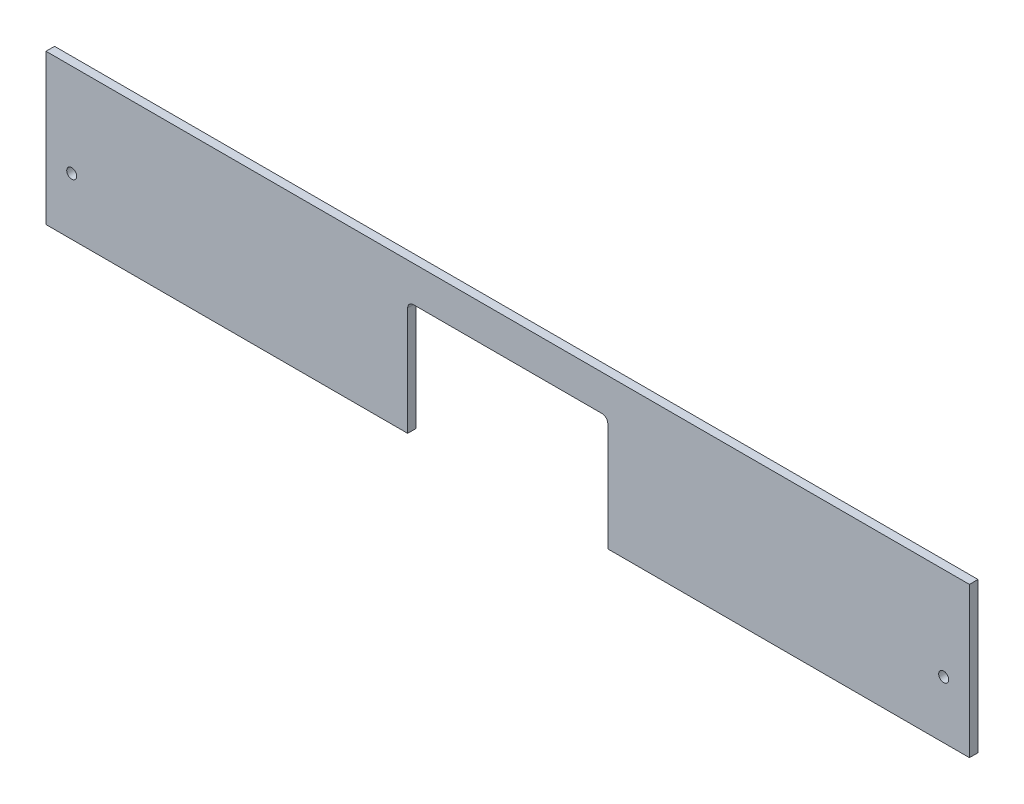
ISO-10303-21;
HEADER;
FILE_DESCRIPTION(('STEP AP214'),'2;1');
FILE_NAME('part.step','',(''),(''),'','','');
FILE_SCHEMA(('AUTOMOTIVE_DESIGN { 1 0 10303 214 1 1 1 1 }'));
ENDSEC;
DATA;
#1=APPLICATION_CONTEXT('core data for automotive mechanical design processes');
#2=APPLICATION_PROTOCOL_DEFINITION('international standard','automotive_design',2000,#1);
#3=PRODUCT_CONTEXT('',#1,'mechanical');
#4=PRODUCT('Part','Part','',(#3));
#5=PRODUCT_RELATED_PRODUCT_CATEGORY('part','',(#4));
#6=PRODUCT_DEFINITION_FORMATION('','',#4);
#7=PRODUCT_DEFINITION_CONTEXT('part definition',#1,'design');
#8=PRODUCT_DEFINITION('design','',#6,#7);
#9=PRODUCT_DEFINITION_SHAPE('','',#8);
#10=(LENGTH_UNIT() NAMED_UNIT(*) SI_UNIT(.MILLI.,.METRE.));
#11=(NAMED_UNIT(*) PLANE_ANGLE_UNIT() SI_UNIT($,.RADIAN.));
#12=(NAMED_UNIT(*) SI_UNIT($,.STERADIAN.) SOLID_ANGLE_UNIT());
#13=UNCERTAINTY_MEASURE_WITH_UNIT(LENGTH_MEASURE(1.E-05),#10,'distance_accuracy_value','');
#14=(GEOMETRIC_REPRESENTATION_CONTEXT(3) GLOBAL_UNCERTAINTY_ASSIGNED_CONTEXT((#13)) GLOBAL_UNIT_ASSIGNED_CONTEXT((#10,
#11,#12)) REPRESENTATION_CONTEXT('',''));
#15=CARTESIAN_POINT('',(0.,0.,0.));
#16=DIRECTION('',(0.,0.,1.));
#17=DIRECTION('',(1.,0.,0.));
#18=AXIS2_PLACEMENT_3D('',#15,#16,#17);
#19=CARTESIAN_POINT('',(-161.5,-25.,3.));
#20=DIRECTION('',(0.,1.,0.));
#21=DIRECTION('',(0.,0.,1.));
#22=AXIS2_PLACEMENT_3D('',#19,#20,#21);
#23=PLANE('',#22);
#24=DIRECTION('',(1.,0.,0.));
#25=VECTOR('',#24,1.);
#26=CARTESIAN_POINT('',(-161.5,-25.,0.));
#27=LINE('',#26,#25);
#28=CARTESIAN_POINT('',(-161.5,-25.,0.));
#29=VERTEX_POINT('',#28);
#30=CARTESIAN_POINT('',(-35.,-25.,0.));
#31=VERTEX_POINT('',#30);
#32=EDGE_CURVE('E175',#29,#31,#27,.T.);
#33=ORIENTED_EDGE('',*,*,#32,.T.);
#34=DIRECTION('',(0.,0.,1.));
#35=VECTOR('',#34,1.);
#36=CARTESIAN_POINT('',(-35.,-25.,0.));
#37=LINE('',#36,#35);
#38=CARTESIAN_POINT('',(-35.,-25.,3.));
#39=VERTEX_POINT('',#38);
#40=EDGE_CURVE('E160',#31,#39,#37,.T.);
#41=ORIENTED_EDGE('',*,*,#40,.T.);
#42=DIRECTION('',(1.,0.,0.));
#43=VECTOR('',#42,1.);
#44=CARTESIAN_POINT('',(-161.5,-25.,3.));
#45=LINE('',#44,#43);
#46=CARTESIAN_POINT('',(-161.5,-25.,3.));
#47=VERTEX_POINT('',#46);
#48=EDGE_CURVE('E178',#47,#39,#45,.T.);
#49=ORIENTED_EDGE('',*,*,#48,.F.);
#50=DIRECTION('',(0.,0.,-1.));
#51=VECTOR('',#50,1.);
#52=CARTESIAN_POINT('',(-161.5,-25.,3.));
#53=LINE('',#52,#51);
#54=EDGE_CURVE('E186',#47,#29,#53,.T.);
#55=ORIENTED_EDGE('',*,*,#54,.T.);
#56=EDGE_LOOP('',(#33,#41,#49,#55));
#57=FACE_BOUND('',#56,.T.);
#58=ADVANCED_FACE('F40',(#57),#23,.F.);
#59=CARTESIAN_POINT('',(161.5,25.,3.));
#60=DIRECTION('',(-1.,0.,0.));
#61=DIRECTION('',(0.,0.,1.));
#62=AXIS2_PLACEMENT_3D('',#59,#60,#61);
#63=PLANE('',#62);
#64=DIRECTION('',(0.,1.,0.));
#65=VECTOR('',#64,1.);
#66=CARTESIAN_POINT('',(161.5,25.,0.));
#67=LINE('',#66,#65);
#68=CARTESIAN_POINT('',(161.5,-25.,0.));
#69=VERTEX_POINT('',#68);
#70=CARTESIAN_POINT('',(161.5,27.5,0.));
#71=VERTEX_POINT('',#70);
#72=EDGE_CURVE('E117',#69,#71,#67,.T.);
#73=ORIENTED_EDGE('',*,*,#72,.T.);
#74=DIRECTION('',(0.,0.,-1.));
#75=VECTOR('',#74,1.);
#76=CARTESIAN_POINT('',(161.5,27.5,3.));
#77=LINE('',#76,#75);
#78=CARTESIAN_POINT('',(161.5,27.5,3.));
#79=VERTEX_POINT('',#78);
#80=EDGE_CURVE('E122',#79,#71,#77,.T.);
#81=ORIENTED_EDGE('',*,*,#80,.F.);
#82=DIRECTION('',(0.,1.,0.));
#83=VECTOR('',#82,1.);
#84=CARTESIAN_POINT('',(161.5,25.,3.));
#85=LINE('',#84,#83);
#86=CARTESIAN_POINT('',(161.5,-25.,3.));
#87=VERTEX_POINT('',#86);
#88=EDGE_CURVE('E172',#87,#79,#85,.T.);
#89=ORIENTED_EDGE('',*,*,#88,.F.);
#90=DIRECTION('',(0.,0.,-1.));
#91=VECTOR('',#90,1.);
#92=CARTESIAN_POINT('',(161.5,-25.,3.));
#93=LINE('',#92,#91);
#94=EDGE_CURVE('E124',#87,#69,#93,.T.);
#95=ORIENTED_EDGE('',*,*,#94,.T.);
#96=EDGE_LOOP('',(#73,#81,#89,#95));
#97=FACE_BOUND('',#96,.T.);
#98=ADVANCED_FACE('F119',(#97),#63,.F.);
#99=CARTESIAN_POINT('',(-161.5,25.,3.));
#100=DIRECTION('',(1.,0.,0.));
#101=DIRECTION('',(0.,0.,-1.));
#102=AXIS2_PLACEMENT_3D('',#99,#100,#101);
#103=PLANE('',#102);
#104=DIRECTION('',(0.,-1.,0.));
#105=VECTOR('',#104,1.);
#106=CARTESIAN_POINT('',(-161.5,25.,0.));
#107=LINE('',#106,#105);
#108=CARTESIAN_POINT('',(-161.5,27.5,0.));
#109=VERTEX_POINT('',#108);
#110=EDGE_CURVE('E126',#109,#29,#107,.T.);
#111=ORIENTED_EDGE('',*,*,#110,.T.);
#112=ORIENTED_EDGE('',*,*,#54,.F.);
#113=DIRECTION('',(0.,-1.,0.));
#114=VECTOR('',#113,1.);
#115=CARTESIAN_POINT('',(-161.5,25.,3.));
#116=LINE('',#115,#114);
#117=CARTESIAN_POINT('',(-161.5,27.5,3.));
#118=VERTEX_POINT('',#117);
#119=EDGE_CURVE('E174',#118,#47,#116,.T.);
#120=ORIENTED_EDGE('',*,*,#119,.F.);
#121=DIRECTION('',(0.,0.,1.));
#122=VECTOR('',#121,1.);
#123=CARTESIAN_POINT('',(-161.5,27.5,0.));
#124=LINE('',#123,#122);
#125=EDGE_CURVE('E137',#109,#118,#124,.T.);
#126=ORIENTED_EDGE('',*,*,#125,.F.);
#127=EDGE_LOOP('',(#111,#112,#120,#126));
#128=FACE_BOUND('',#127,.T.);
#129=ADVANCED_FACE('F216',(#128),#103,.F.);
#130=CARTESIAN_POINT('',(35.,-25.,3.));
#131=VERTEX_POINT('',#130);
#132=EDGE_CURVE('E177',#131,#87,#45,.T.);
#133=ORIENTED_EDGE('',*,*,#132,.F.);
#134=DIRECTION('',(0.,0.,1.));
#135=VECTOR('',#134,1.);
#136=CARTESIAN_POINT('',(35.,-25.,0.));
#137=LINE('',#136,#135);
#138=CARTESIAN_POINT('',(35.,-25.,0.));
#139=VERTEX_POINT('',#138);
#140=EDGE_CURVE('E161',#139,#131,#137,.T.);
#141=ORIENTED_EDGE('',*,*,#140,.F.);
#142=EDGE_CURVE('E182',#139,#69,#27,.T.);
#143=ORIENTED_EDGE('',*,*,#142,.T.);
#144=ORIENTED_EDGE('',*,*,#94,.F.);
#145=EDGE_LOOP('',(#133,#141,#143,#144));
#146=FACE_BOUND('',#145,.T.);
#147=ADVANCED_FACE('F221',(#146),#23,.F.);
#148=CARTESIAN_POINT('',(0.,0.,3.));
#149=DIRECTION('',(0.,0.,1.));
#150=DIRECTION('',(1.,0.,0.));
#151=AXIS2_PLACEMENT_3D('',#148,#149,#150);
#152=PLANE('',#151);
#153=CARTESIAN_POINT('',(-152.5,-5.,3.));
#154=DIRECTION('',(0.,0.,1.));
#155=DIRECTION('',(1.,0.,0.));
#156=AXIS2_PLACEMENT_3D('',#153,#154,#155);
#157=CIRCLE('',#156,1.75000000000001);
#158=CARTESIAN_POINT('',(-150.75,-5.,3.));
#159=VERTEX_POINT('',#158);
#160=EDGE_CURVE('E146',#159,#159,#157,.T.);
#161=ORIENTED_EDGE('',*,*,#160,.F.);
#162=EDGE_LOOP('',(#161));
#163=FACE_BOUND('',#162,.T.);
#164=CARTESIAN_POINT('',(152.5,-4.99999999999984,3.));
#165=DIRECTION('',(0.,0.,1.));
#166=DIRECTION('',(-1.,0.,0.));
#167=AXIS2_PLACEMENT_3D('',#164,#165,#166);
#168=CIRCLE('',#167,1.75000000000001);
#169=CARTESIAN_POINT('',(150.75,-4.99999999999984,3.));
#170=VERTEX_POINT('',#169);
#171=EDGE_CURVE('E407',#170,#170,#168,.T.);
#172=ORIENTED_EDGE('',*,*,#171,.F.);
#173=EDGE_LOOP('',(#172));
#174=FACE_BOUND('',#173,.T.);
#175=DIRECTION('',(0.,-1.,0.));
#176=VECTOR('',#175,1.);
#177=CARTESIAN_POINT('',(-35.,0.,3.));
#178=LINE('',#177,#176);
#179=CARTESIAN_POINT('',(-35.,13.,3.));
#180=VERTEX_POINT('',#179);
#181=EDGE_CURVE('E127',#180,#39,#178,.T.);
#182=ORIENTED_EDGE('',*,*,#181,.F.);
#183=CARTESIAN_POINT('',(-33.,13.,3.));
#184=DIRECTION('',(0.,0.,1.));
#185=DIRECTION('',(1.,0.,0.));
#186=AXIS2_PLACEMENT_3D('',#183,#184,#185);
#187=CIRCLE('',#186,2.);
#188=CARTESIAN_POINT('',(-33.,15.,3.));
#189=VERTEX_POINT('',#188);
#190=EDGE_CURVE('E48',#180,#189,#187,.F.);
#191=ORIENTED_EDGE('',*,*,#190,.T.);
#192=DIRECTION('',(-1.,0.,0.));
#193=VECTOR('',#192,1.);
#194=CARTESIAN_POINT('',(0.,15.,3.));
#195=LINE('',#194,#193);
#196=CARTESIAN_POINT('',(33.,15.,3.));
#197=VERTEX_POINT('',#196);
#198=EDGE_CURVE('E168',#197,#189,#195,.T.);
#199=ORIENTED_EDGE('',*,*,#198,.F.);
#200=CARTESIAN_POINT('',(33.,13.,3.));
#201=DIRECTION('',(0.,0.,1.));
#202=DIRECTION('',(1.,0.,0.));
#203=AXIS2_PLACEMENT_3D('',#200,#201,#202);
#204=CIRCLE('',#203,2.);
#205=CARTESIAN_POINT('',(35.,13.,3.));
#206=VERTEX_POINT('',#205);
#207=EDGE_CURVE('E198',#197,#206,#204,.F.);
#208=ORIENTED_EDGE('',*,*,#207,.T.);
#209=DIRECTION('',(0.,1.,0.));
#210=VECTOR('',#209,1.);
#211=CARTESIAN_POINT('',(35.,0.,3.));
#212=LINE('',#211,#210);
#213=EDGE_CURVE('E163',#131,#206,#212,.T.);
#214=ORIENTED_EDGE('',*,*,#213,.F.);
#215=ORIENTED_EDGE('',*,*,#132,.T.);
#216=ORIENTED_EDGE('',*,*,#88,.T.);
#217=DIRECTION('',(1.,0.,0.));
#218=VECTOR('',#217,1.);
#219=CARTESIAN_POINT('',(-161.5,27.5,3.));
#220=LINE('',#219,#218);
#221=EDGE_CURVE('E142',#118,#79,#220,.T.);
#222=ORIENTED_EDGE('',*,*,#221,.F.);
#223=ORIENTED_EDGE('',*,*,#119,.T.);
#224=ORIENTED_EDGE('',*,*,#48,.T.);
#225=EDGE_LOOP('',(#182,#191,#199,#208,#214,#215,#216,#222,#223,#224));
#226=FACE_BOUND('',#225,.T.);
#227=ADVANCED_FACE('F204',(#163,#174,#226),#152,.T.);
#228=CARTESIAN_POINT('',(0.,0.,0.));
#229=DIRECTION('',(0.,0.,1.));
#230=DIRECTION('',(1.,0.,0.));
#231=AXIS2_PLACEMENT_3D('',#228,#229,#230);
#232=PLANE('',#231);
#233=CARTESIAN_POINT('',(-152.5,-5.,0.));
#234=DIRECTION('',(0.,0.,1.));
#235=DIRECTION('',(1.,0.,0.));
#236=AXIS2_PLACEMENT_3D('',#233,#234,#235);
#237=CIRCLE('',#236,1.75000000000001);
#238=CARTESIAN_POINT('',(-150.75,-5.,0.));
#239=VERTEX_POINT('',#238);
#240=EDGE_CURVE('E143',#239,#239,#237,.T.);
#241=ORIENTED_EDGE('',*,*,#240,.T.);
#242=EDGE_LOOP('',(#241));
#243=FACE_BOUND('',#242,.T.);
#244=CARTESIAN_POINT('',(152.5,-4.99999999999984,0.));
#245=DIRECTION('',(0.,0.,1.));
#246=DIRECTION('',(-1.,0.,0.));
#247=AXIS2_PLACEMENT_3D('',#244,#245,#246);
#248=CIRCLE('',#247,1.75000000000001);
#249=CARTESIAN_POINT('',(150.75,-4.99999999999984,0.));
#250=VERTEX_POINT('',#249);
#251=EDGE_CURVE('E149',#250,#250,#248,.T.);
#252=ORIENTED_EDGE('',*,*,#251,.T.);
#253=EDGE_LOOP('',(#252));
#254=FACE_BOUND('',#253,.T.);
#255=DIRECTION('',(0.,1.,0.));
#256=VECTOR('',#255,1.);
#257=CARTESIAN_POINT('',(35.,-25.,0.));
#258=LINE('',#257,#256);
#259=CARTESIAN_POINT('',(35.,13.,0.));
#260=VERTEX_POINT('',#259);
#261=EDGE_CURVE('E156',#139,#260,#258,.T.);
#262=ORIENTED_EDGE('',*,*,#261,.T.);
#263=CARTESIAN_POINT('',(33.,13.,0.));
#264=DIRECTION('',(0.,0.,1.));
#265=DIRECTION('',(1.,0.,0.));
#266=AXIS2_PLACEMENT_3D('',#263,#264,#265);
#267=CIRCLE('',#266,2.);
#268=CARTESIAN_POINT('',(33.,15.,0.));
#269=VERTEX_POINT('',#268);
#270=EDGE_CURVE('E200',#260,#269,#267,.T.);
#271=ORIENTED_EDGE('',*,*,#270,.T.);
#272=DIRECTION('',(-1.,0.,0.));
#273=VECTOR('',#272,1.);
#274=CARTESIAN_POINT('',(-35.,15.,0.));
#275=LINE('',#274,#273);
#276=CARTESIAN_POINT('',(-33.,15.,0.));
#277=VERTEX_POINT('',#276);
#278=EDGE_CURVE('E158',#269,#277,#275,.T.);
#279=ORIENTED_EDGE('',*,*,#278,.T.);
#280=CARTESIAN_POINT('',(-33.,13.,0.));
#281=DIRECTION('',(0.,0.,1.));
#282=DIRECTION('',(1.,0.,0.));
#283=AXIS2_PLACEMENT_3D('',#280,#281,#282);
#284=CIRCLE('',#283,2.);
#285=CARTESIAN_POINT('',(-35.,13.,0.));
#286=VERTEX_POINT('',#285);
#287=EDGE_CURVE('E11',#277,#286,#284,.T.);
#288=ORIENTED_EDGE('',*,*,#287,.T.);
#289=DIRECTION('',(0.,-1.,0.));
#290=VECTOR('',#289,1.);
#291=CARTESIAN_POINT('',(-35.,-25.,0.));
#292=LINE('',#291,#290);
#293=EDGE_CURVE('E154',#286,#31,#292,.T.);
#294=ORIENTED_EDGE('',*,*,#293,.T.);
#295=ORIENTED_EDGE('',*,*,#32,.F.);
#296=ORIENTED_EDGE('',*,*,#110,.F.);
#297=DIRECTION('',(-1.,0.,0.));
#298=VECTOR('',#297,1.);
#299=CARTESIAN_POINT('',(161.5,27.5,0.));
#300=LINE('',#299,#298);
#301=EDGE_CURVE('E130',#71,#109,#300,.T.);
#302=ORIENTED_EDGE('',*,*,#301,.F.);
#303=ORIENTED_EDGE('',*,*,#72,.F.);
#304=ORIENTED_EDGE('',*,*,#142,.F.);
#305=EDGE_LOOP('',(#262,#271,#279,#288,#294,#295,#296,#302,#303,#304));
#306=FACE_BOUND('',#305,.T.);
#307=ADVANCED_FACE('F132',(#243,#254,#306),#232,.F.);
#308=CARTESIAN_POINT('',(-35.,-25.,0.));
#309=DIRECTION('',(-1.,0.,0.));
#310=DIRECTION('',(0.,0.,1.));
#311=AXIS2_PLACEMENT_3D('',#308,#309,#310);
#312=PLANE('',#311);
#313=ORIENTED_EDGE('',*,*,#293,.F.);
#314=DIRECTION('',(0.,0.,1.));
#315=VECTOR('',#314,1.);
#316=CARTESIAN_POINT('',(-35.,13.,3.));
#317=LINE('',#316,#315);
#318=EDGE_CURVE('E196',#286,#180,#317,.T.);
#319=ORIENTED_EDGE('',*,*,#318,.T.);
#320=ORIENTED_EDGE('',*,*,#181,.T.);
#321=ORIENTED_EDGE('',*,*,#40,.F.);
#322=EDGE_LOOP('',(#313,#319,#320,#321));
#323=FACE_BOUND('',#322,.T.);
#324=ADVANCED_FACE('F210',(#323),#312,.F.);
#325=CARTESIAN_POINT('',(-35.,15.,0.));
#326=DIRECTION('',(0.,1.,0.));
#327=DIRECTION('',(0.,0.,1.));
#328=AXIS2_PLACEMENT_3D('',#325,#326,#327);
#329=PLANE('',#328);
#330=ORIENTED_EDGE('',*,*,#278,.F.);
#331=DIRECTION('',(0.,0.,1.));
#332=VECTOR('',#331,1.);
#333=CARTESIAN_POINT('',(33.,15.,3.));
#334=LINE('',#333,#332);
#335=EDGE_CURVE('E191',#269,#197,#334,.T.);
#336=ORIENTED_EDGE('',*,*,#335,.T.);
#337=ORIENTED_EDGE('',*,*,#198,.T.);
#338=DIRECTION('',(0.,0.,1.));
#339=VECTOR('',#338,1.);
#340=CARTESIAN_POINT('',(-33.,15.,0.));
#341=LINE('',#340,#339);
#342=EDGE_CURVE('E189',#189,#277,#341,.F.);
#343=ORIENTED_EDGE('',*,*,#342,.T.);
#344=EDGE_LOOP('',(#330,#336,#337,#343));
#345=FACE_BOUND('',#344,.T.);
#346=ADVANCED_FACE('F207',(#345),#329,.F.);
#347=CARTESIAN_POINT('',(35.,-25.,0.));
#348=DIRECTION('',(1.,0.,0.));
#349=DIRECTION('',(0.,1.,0.));
#350=AXIS2_PLACEMENT_3D('',#347,#348,#349);
#351=PLANE('',#350);
#352=ORIENTED_EDGE('',*,*,#213,.T.);
#353=DIRECTION('',(0.,0.,1.));
#354=VECTOR('',#353,1.);
#355=CARTESIAN_POINT('',(35.,13.,0.));
#356=LINE('',#355,#354);
#357=EDGE_CURVE('E194',#206,#260,#356,.F.);
#358=ORIENTED_EDGE('',*,*,#357,.T.);
#359=ORIENTED_EDGE('',*,*,#261,.F.);
#360=ORIENTED_EDGE('',*,*,#140,.T.);
#361=EDGE_LOOP('',(#352,#358,#359,#360));
#362=FACE_BOUND('',#361,.T.);
#363=ADVANCED_FACE('F227',(#362),#351,.F.);
#364=CARTESIAN_POINT('',(33.,13.,0.));
#365=DIRECTION('',(0.,0.,-1.));
#366=DIRECTION('',(-1.,0.,0.));
#367=AXIS2_PLACEMENT_3D('',#364,#365,#366);
#368=CYLINDRICAL_SURFACE('',#367,2.);
#369=ORIENTED_EDGE('',*,*,#270,.F.);
#370=ORIENTED_EDGE('',*,*,#357,.F.);
#371=ORIENTED_EDGE('',*,*,#207,.F.);
#372=ORIENTED_EDGE('',*,*,#335,.F.);
#373=EDGE_LOOP('',(#369,#370,#371,#372));
#374=FACE_BOUND('',#373,.T.);
#375=ADVANCED_FACE('F226',(#374),#368,.F.);
#376=CARTESIAN_POINT('',(-33.,13.,0.));
#377=DIRECTION('',(0.,0.,-1.));
#378=DIRECTION('',(-1.,0.,0.));
#379=AXIS2_PLACEMENT_3D('',#376,#377,#378);
#380=CYLINDRICAL_SURFACE('',#379,2.);
#381=ORIENTED_EDGE('',*,*,#287,.F.);
#382=ORIENTED_EDGE('',*,*,#342,.F.);
#383=ORIENTED_EDGE('',*,*,#190,.F.);
#384=ORIENTED_EDGE('',*,*,#318,.F.);
#385=EDGE_LOOP('',(#381,#382,#383,#384));
#386=FACE_BOUND('',#385,.T.);
#387=ADVANCED_FACE('F42',(#386),#380,.F.);
#388=CARTESIAN_POINT('',(0.,27.5,0.));
#389=DIRECTION('',(0.,1.,0.));
#390=DIRECTION('',(0.,0.,1.));
#391=AXIS2_PLACEMENT_3D('',#388,#389,#390);
#392=PLANE('',#391);
#393=ORIENTED_EDGE('',*,*,#80,.T.);
#394=ORIENTED_EDGE('',*,*,#301,.T.);
#395=ORIENTED_EDGE('',*,*,#125,.T.);
#396=ORIENTED_EDGE('',*,*,#221,.T.);
#397=EDGE_LOOP('',(#393,#394,#395,#396));
#398=FACE_BOUND('',#397,.T.);
#399=ADVANCED_FACE('F140',(#398),#392,.T.);
#400=CARTESIAN_POINT('',(152.5,-4.99999999999984,0.));
#401=DIRECTION('',(0.,0.,1.));
#402=DIRECTION('',(1.,0.,0.));
#403=AXIS2_PLACEMENT_3D('',#400,#401,#402);
#404=CYLINDRICAL_SURFACE('',#403,1.75000000000001);
#405=ORIENTED_EDGE('',*,*,#251,.F.);
#406=EDGE_LOOP('',(#405));
#407=FACE_BOUND('',#406,.T.);
#408=ORIENTED_EDGE('',*,*,#171,.T.);
#409=EDGE_LOOP('',(#408));
#410=FACE_BOUND('',#409,.T.);
#411=ADVANCED_FACE('F322',(#407,#410),#404,.F.);
#412=CARTESIAN_POINT('',(-152.5,-5.,0.));
#413=DIRECTION('',(0.,0.,1.));
#414=DIRECTION('',(1.,0.,0.));
#415=AXIS2_PLACEMENT_3D('',#412,#413,#414);
#416=CYLINDRICAL_SURFACE('',#415,1.75000000000001);
#417=ORIENTED_EDGE('',*,*,#240,.F.);
#418=EDGE_LOOP('',(#417));
#419=FACE_BOUND('',#418,.T.);
#420=ORIENTED_EDGE('',*,*,#160,.T.);
#421=EDGE_LOOP('',(#420));
#422=FACE_BOUND('',#421,.T.);
#423=ADVANCED_FACE('F332',(#419,#422),#416,.F.);
#424=CLOSED_SHELL('',(#58,#98,#129,#147,#227,#307,#324,#346,#363,#375,#387,#399,#411,#423));
#425=MANIFOLD_SOLID_BREP('B2',#424);
#426=ADVANCED_BREP_SHAPE_REPRESENTATION('',(#18,#425),#14);
#427=SHAPE_DEFINITION_REPRESENTATION(#9,#426);
ENDSEC;
END-ISO-10303-21;
